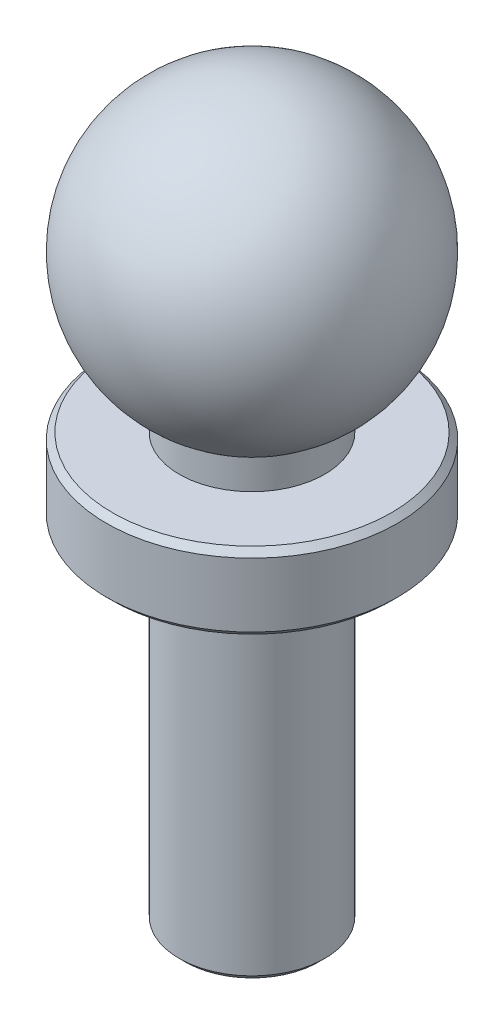
ISO-10303-21;
HEADER;
FILE_DESCRIPTION(('STEP AP214'),'2;1');
FILE_NAME('part.step','',(''),(''),'','','');
FILE_SCHEMA(('AUTOMOTIVE_DESIGN { 1 0 10303 214 1 1 1 1 }'));
ENDSEC;
DATA;
#1=APPLICATION_CONTEXT('core data for automotive mechanical design processes');
#2=APPLICATION_PROTOCOL_DEFINITION('international standard','automotive_design',2000,#1);
#3=PRODUCT_CONTEXT('',#1,'mechanical');
#4=PRODUCT('Part','Part','',(#3));
#5=PRODUCT_RELATED_PRODUCT_CATEGORY('part','',(#4));
#6=PRODUCT_DEFINITION_FORMATION('','',#4);
#7=PRODUCT_DEFINITION_CONTEXT('part definition',#1,'design');
#8=PRODUCT_DEFINITION('design','',#6,#7);
#9=PRODUCT_DEFINITION_SHAPE('','',#8);
#10=(LENGTH_UNIT() NAMED_UNIT(*) SI_UNIT(.MILLI.,.METRE.));
#11=(NAMED_UNIT(*) PLANE_ANGLE_UNIT() SI_UNIT($,.RADIAN.));
#12=(NAMED_UNIT(*) SI_UNIT($,.STERADIAN.) SOLID_ANGLE_UNIT());
#13=UNCERTAINTY_MEASURE_WITH_UNIT(LENGTH_MEASURE(1.E-05),#10,'distance_accuracy_value','');
#14=(GEOMETRIC_REPRESENTATION_CONTEXT(3) GLOBAL_UNCERTAINTY_ASSIGNED_CONTEXT((#13)) GLOBAL_UNIT_ASSIGNED_CONTEXT((#10,
#11,#12)) REPRESENTATION_CONTEXT('',''));
#15=CARTESIAN_POINT('',(0.,0.,0.));
#16=DIRECTION('',(0.,0.,1.));
#17=DIRECTION('',(1.,0.,0.));
#18=AXIS2_PLACEMENT_3D('',#15,#16,#17);
#19=CARTESIAN_POINT('',(0.,7.62,0.));
#20=DIRECTION('',(0.,1.,0.));
#21=DIRECTION('',(1.,0.,0.));
#22=AXIS2_PLACEMENT_3D('',#19,#20,#21);
#23=SPHERICAL_SURFACE('',#22,4.7625);
#24=CARTESIAN_POINT('',(0.,3.4955540144766,0.));
#25=DIRECTION('',(0.,1.,0.));
#26=DIRECTION('',(-1.,0.,0.));
#27=AXIS2_PLACEMENT_3D('',#24,#25,#26);
#28=CIRCLE('',#27,2.38124999999998);
#29=CARTESIAN_POINT('',(-2.38124999999997,3.4955540144766,0.));
#30=VERTEX_POINT('',#29);
#31=EDGE_CURVE('E58',#30,#30,#28,.T.);
#32=ORIENTED_EDGE('',*,*,#31,.T.);
#33=EDGE_LOOP('',(#32));
#34=FACE_BOUND('',#33,.T.);
#35=ADVANCED_FACE('F32',(#34),#23,.T.);
#36=CARTESIAN_POINT('',(0.,48.717648677895,0.));
#37=DIRECTION('',(0.,1.,0.));
#38=DIRECTION('',(-1.,0.,0.));
#39=AXIS2_PLACEMENT_3D('',#36,#37,#38);
#40=CYLINDRICAL_SURFACE('',#39,2.38124999999998);
#41=ORIENTED_EDGE('',*,*,#31,.F.);
#42=EDGE_LOOP('',(#41));
#43=FACE_BOUND('',#42,.T.);
#44=CARTESIAN_POINT('',(0.,2.4955540144766,0.));
#45=DIRECTION('',(0.,1.,0.));
#46=DIRECTION('',(-1.,0.,0.));
#47=AXIS2_PLACEMENT_3D('',#44,#45,#46);
#48=CIRCLE('',#47,2.38124999999998);
#49=CARTESIAN_POINT('',(-2.38124999999997,2.4955540144766,0.));
#50=VERTEX_POINT('',#49);
#51=EDGE_CURVE('E61',#50,#50,#48,.T.);
#52=ORIENTED_EDGE('',*,*,#51,.T.);
#53=EDGE_LOOP('',(#52));
#54=FACE_BOUND('',#53,.T.);
#55=ADVANCED_FACE('F84',(#43,#54),#40,.T.);
#56=CARTESIAN_POINT('',(2.38124999999998,2.4955540144766,0.));
#57=DIRECTION('',(0.,-1.,0.));
#58=DIRECTION('',(1.,0.,0.));
#59=AXIS2_PLACEMENT_3D('',#56,#57,#58);
#60=PLANE('',#59);
#61=CARTESIAN_POINT('',(0.,2.4955540144766,0.));
#62=DIRECTION('',(0.,-1.,0.));
#63=DIRECTION('',(1.,0.,0.));
#64=AXIS2_PLACEMENT_3D('',#61,#62,#63);
#65=CIRCLE('',#64,4.5625);
#66=CARTESIAN_POINT('',(4.5625,2.4955540144766,0.));
#67=VERTEX_POINT('',#66);
#68=EDGE_CURVE('E55',#67,#67,#65,.F.);
#69=ORIENTED_EDGE('',*,*,#68,.T.);
#70=EDGE_LOOP('',(#69));
#71=FACE_BOUND('',#70,.T.);
#72=ORIENTED_EDGE('',*,*,#51,.F.);
#73=EDGE_LOOP('',(#72));
#74=FACE_BOUND('',#73,.T.);
#75=ADVANCED_FACE('F90',(#71,#74),#60,.F.);
#76=CARTESIAN_POINT('',(0.,48.717648677895,0.));
#77=DIRECTION('',(0.,1.,0.));
#78=DIRECTION('',(-1.,0.,0.));
#79=AXIS2_PLACEMENT_3D('',#76,#77,#78);
#80=CYLINDRICAL_SURFACE('',#79,4.7625);
#81=CARTESIAN_POINT('',(0.,2.29555401447659,0.));
#82=DIRECTION('',(0.,-1.,0.));
#83=DIRECTION('',(1.,0.,0.));
#84=AXIS2_PLACEMENT_3D('',#81,#82,#83);
#85=CIRCLE('',#84,4.7625);
#86=CARTESIAN_POINT('',(4.76250000000001,2.29555401447659,0.));
#87=VERTEX_POINT('',#86);
#88=EDGE_CURVE('E47',#87,#87,#85,.T.);
#89=ORIENTED_EDGE('',*,*,#88,.T.);
#90=EDGE_LOOP('',(#89));
#91=FACE_BOUND('',#90,.T.);
#92=CARTESIAN_POINT('',(0.,0.199999999999999,0.));
#93=DIRECTION('',(0.,1.,0.));
#94=DIRECTION('',(-1.,0.,0.));
#95=AXIS2_PLACEMENT_3D('',#92,#93,#94);
#96=CIRCLE('',#95,4.7625);
#97=CARTESIAN_POINT('',(-4.7625,0.199999999999998,0.));
#98=VERTEX_POINT('',#97);
#99=EDGE_CURVE('E52',#98,#98,#96,.T.);
#100=ORIENTED_EDGE('',*,*,#99,.T.);
#101=EDGE_LOOP('',(#100));
#102=FACE_BOUND('',#101,.T.);
#103=ADVANCED_FACE('F81',(#91,#102),#80,.T.);
#104=CARTESIAN_POINT('',(4.76250000000001,0.,0.));
#105=DIRECTION('',(0.,1.,0.));
#106=DIRECTION('',(-1.,0.,0.));
#107=AXIS2_PLACEMENT_3D('',#104,#105,#106);
#108=PLANE('',#107);
#109=CARTESIAN_POINT('',(0.,0.,0.));
#110=DIRECTION('',(0.,1.,0.));
#111=DIRECTION('',(-1.,0.,0.));
#112=AXIS2_PLACEMENT_3D('',#109,#110,#111);
#113=CIRCLE('',#112,4.5625);
#114=CARTESIAN_POINT('',(-4.56249999999999,0.,0.));
#115=VERTEX_POINT('',#114);
#116=EDGE_CURVE('E10',#115,#115,#113,.F.);
#117=ORIENTED_EDGE('',*,*,#116,.T.);
#118=EDGE_LOOP('',(#117));
#119=FACE_BOUND('',#118,.T.);
#120=CARTESIAN_POINT('',(0.,0.,0.));
#121=DIRECTION('',(0.,1.,0.));
#122=DIRECTION('',(-1.,0.,0.));
#123=AXIS2_PLACEMENT_3D('',#120,#121,#122);
#124=CIRCLE('',#123,2.38125);
#125=CARTESIAN_POINT('',(-2.38124999999999,0.,0.));
#126=VERTEX_POINT('',#125);
#127=EDGE_CURVE('E64',#126,#126,#124,.T.);
#128=ORIENTED_EDGE('',*,*,#127,.T.);
#129=EDGE_LOOP('',(#128));
#130=FACE_BOUND('',#129,.T.);
#131=ADVANCED_FACE('F68',(#119,#130),#108,.F.);
#132=CARTESIAN_POINT('',(0.,48.717648677895,0.));
#133=DIRECTION('',(0.,1.,0.));
#134=DIRECTION('',(-1.,0.,0.));
#135=AXIS2_PLACEMENT_3D('',#132,#133,#134);
#136=CYLINDRICAL_SURFACE('',#135,2.38125);
#137=CARTESIAN_POINT('',(0.,-11.23,0.));
#138=DIRECTION('',(0.,1.,0.));
#139=DIRECTION('',(-1.,0.,0.));
#140=AXIS2_PLACEMENT_3D('',#137,#138,#139);
#141=CIRCLE('',#140,2.38125);
#142=CARTESIAN_POINT('',(-2.38124999999999,-11.23,0.));
#143=VERTEX_POINT('',#142);
#144=EDGE_CURVE('E43',#143,#143,#141,.T.);
#145=ORIENTED_EDGE('',*,*,#144,.T.);
#146=EDGE_LOOP('',(#145));
#147=FACE_BOUND('',#146,.T.);
#148=ORIENTED_EDGE('',*,*,#127,.F.);
#149=EDGE_LOOP('',(#148));
#150=FACE_BOUND('',#149,.T.);
#151=ADVANCED_FACE('F70',(#147,#150),#136,.T.);
#152=CARTESIAN_POINT('',(2.38125000000001,-11.43,0.));
#153=DIRECTION('',(0.,1.,0.));
#154=DIRECTION('',(-1.,0.,0.));
#155=AXIS2_PLACEMENT_3D('',#152,#153,#154);
#156=PLANE('',#155);
#157=CARTESIAN_POINT('',(0.,-11.43,0.));
#158=DIRECTION('',(0.,1.,0.));
#159=DIRECTION('',(-1.,0.,0.));
#160=AXIS2_PLACEMENT_3D('',#157,#158,#159);
#161=CIRCLE('',#160,2.18125000000001);
#162=CARTESIAN_POINT('',(-2.18125,-11.43,0.));
#163=VERTEX_POINT('',#162);
#164=EDGE_CURVE('E39',#163,#163,#161,.F.);
#165=ORIENTED_EDGE('',*,*,#164,.T.);
#166=EDGE_LOOP('',(#165));
#167=FACE_BOUND('',#166,.T.);
#168=ADVANCED_FACE('F72',(#167),#156,.F.);
#169=CARTESIAN_POINT('',(0.,2.4955540144766,0.));
#170=DIRECTION('',(0.,-1.,0.));
#171=DIRECTION('',(1.,0.,0.));
#172=AXIS2_PLACEMENT_3D('',#169,#170,#171);
#173=CONICAL_SURFACE('',#172,4.5625,0.78539816339745);
#174=ORIENTED_EDGE('',*,*,#88,.F.);
#175=EDGE_LOOP('',(#174));
#176=FACE_BOUND('',#175,.T.);
#177=ORIENTED_EDGE('',*,*,#68,.F.);
#178=EDGE_LOOP('',(#177));
#179=FACE_BOUND('',#178,.T.);
#180=ADVANCED_FACE('F79',(#176,#179),#173,.T.);
#181=CARTESIAN_POINT('',(0.,-11.23,0.));
#182=DIRECTION('',(0.,1.,0.));
#183=DIRECTION('',(-1.,0.,0.));
#184=AXIS2_PLACEMENT_3D('',#181,#182,#183);
#185=CONICAL_SURFACE('',#184,2.38125,0.785398163397439);
#186=ORIENTED_EDGE('',*,*,#164,.F.);
#187=EDGE_LOOP('',(#186));
#188=FACE_BOUND('',#187,.T.);
#189=ORIENTED_EDGE('',*,*,#144,.F.);
#190=EDGE_LOOP('',(#189));
#191=FACE_BOUND('',#190,.T.);
#192=ADVANCED_FACE('F96',(#188,#191),#185,.T.);
#193=CARTESIAN_POINT('',(0.,0.199999999999999,0.));
#194=DIRECTION('',(0.,1.,0.));
#195=DIRECTION('',(-1.,0.,0.));
#196=AXIS2_PLACEMENT_3D('',#193,#194,#195);
#197=CONICAL_SURFACE('',#196,4.7625,0.785398163397459);
#198=ORIENTED_EDGE('',*,*,#116,.F.);
#199=EDGE_LOOP('',(#198));
#200=FACE_BOUND('',#199,.T.);
#201=ORIENTED_EDGE('',*,*,#99,.F.);
#202=EDGE_LOOP('',(#201));
#203=FACE_BOUND('',#202,.T.);
#204=ADVANCED_FACE('F34',(#200,#203),#197,.T.);
#205=CLOSED_SHELL('',(#35,#55,#75,#103,#131,#151,#168,#180,#192,#204));
#206=MANIFOLD_SOLID_BREP('B2',#205);
#207=ADVANCED_BREP_SHAPE_REPRESENTATION('',(#18,#206),#14);
#208=SHAPE_DEFINITION_REPRESENTATION(#9,#207);
ENDSEC;
END-ISO-10303-21;
